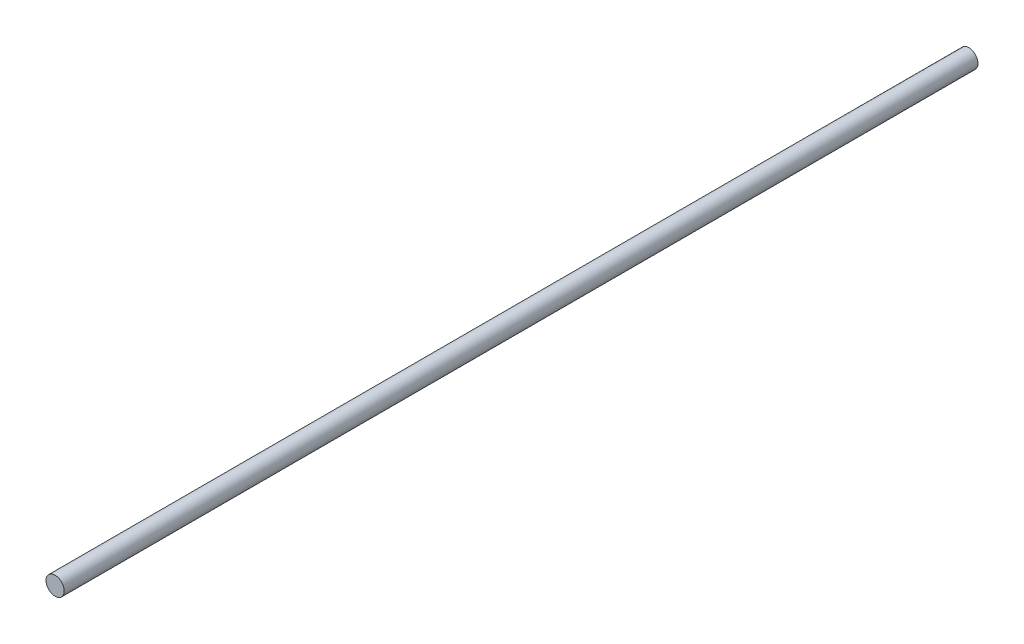
ISO-10303-21;
HEADER;
FILE_DESCRIPTION(('STEP AP214'),'2;1');
FILE_NAME('part.step','',(''),(''),'','','');
FILE_SCHEMA(('AUTOMOTIVE_DESIGN { 1 0 10303 214 1 1 1 1 }'));
ENDSEC;
DATA;
#1=APPLICATION_CONTEXT('core data for automotive mechanical design processes');
#2=APPLICATION_PROTOCOL_DEFINITION('international standard','automotive_design',2000,#1);
#3=PRODUCT_CONTEXT('',#1,'mechanical');
#4=PRODUCT('Part','Part','',(#3));
#5=PRODUCT_RELATED_PRODUCT_CATEGORY('part','',(#4));
#6=PRODUCT_DEFINITION_FORMATION('','',#4);
#7=PRODUCT_DEFINITION_CONTEXT('part definition',#1,'design');
#8=PRODUCT_DEFINITION('design','',#6,#7);
#9=PRODUCT_DEFINITION_SHAPE('','',#8);
#10=(LENGTH_UNIT() NAMED_UNIT(*) SI_UNIT(.MILLI.,.METRE.));
#11=(NAMED_UNIT(*) PLANE_ANGLE_UNIT() SI_UNIT($,.RADIAN.));
#12=(NAMED_UNIT(*) SI_UNIT($,.STERADIAN.) SOLID_ANGLE_UNIT());
#13=UNCERTAINTY_MEASURE_WITH_UNIT(LENGTH_MEASURE(1.E-05),#10,'distance_accuracy_value','');
#14=(GEOMETRIC_REPRESENTATION_CONTEXT(3) GLOBAL_UNCERTAINTY_ASSIGNED_CONTEXT((#13)) GLOBAL_UNIT_ASSIGNED_CONTEXT((#10,
#11,#12)) REPRESENTATION_CONTEXT('',''));
#15=CARTESIAN_POINT('',(0.,0.,0.));
#16=DIRECTION('',(0.,0.,1.));
#17=DIRECTION('',(1.,0.,0.));
#18=AXIS2_PLACEMENT_3D('',#15,#16,#17);
#19=CARTESIAN_POINT('',(0.,0.,50.));
#20=DIRECTION('',(0.,0.,-1.));
#21=DIRECTION('',(-1.,0.,0.));
#22=AXIS2_PLACEMENT_3D('',#19,#20,#21);
#23=CYLINDRICAL_SURFACE('',#22,0.5);
#24=CARTESIAN_POINT('',(0.,0.,50.));
#25=DIRECTION('',(0.,0.,1.));
#26=DIRECTION('',(1.,0.,0.));
#27=AXIS2_PLACEMENT_3D('',#24,#25,#26);
#28=CIRCLE('',#27,0.5);
#29=CARTESIAN_POINT('',(0.5,0.,50.));
#30=VERTEX_POINT('',#29);
#31=EDGE_CURVE('E10',#30,#30,#28,.T.);
#32=ORIENTED_EDGE('',*,*,#31,.F.);
#33=EDGE_LOOP('',(#32));
#34=FACE_BOUND('',#33,.T.);
#35=CARTESIAN_POINT('',(0.,0.,0.));
#36=DIRECTION('',(0.,0.,1.));
#37=DIRECTION('',(1.,0.,0.));
#38=AXIS2_PLACEMENT_3D('',#35,#36,#37);
#39=CIRCLE('',#38,0.5);
#40=CARTESIAN_POINT('',(0.5,0.,0.));
#41=VERTEX_POINT('',#40);
#42=EDGE_CURVE('E40',#41,#41,#39,.T.);
#43=ORIENTED_EDGE('',*,*,#42,.T.);
#44=EDGE_LOOP('',(#43));
#45=FACE_BOUND('',#44,.T.);
#46=ADVANCED_FACE('F37',(#34,#45),#23,.T.);
#47=CARTESIAN_POINT('',(0.,0.,50.));
#48=DIRECTION('',(0.,0.,1.));
#49=DIRECTION('',(1.,0.,0.));
#50=AXIS2_PLACEMENT_3D('',#47,#48,#49);
#51=PLANE('',#50);
#52=ORIENTED_EDGE('',*,*,#31,.T.);
#53=EDGE_LOOP('',(#52));
#54=FACE_BOUND('',#53,.T.);
#55=ADVANCED_FACE('F54',(#54),#51,.T.);
#56=CARTESIAN_POINT('',(0.,0.,0.));
#57=DIRECTION('',(0.,0.,1.));
#58=DIRECTION('',(1.,0.,0.));
#59=AXIS2_PLACEMENT_3D('',#56,#57,#58);
#60=PLANE('',#59);
#61=ORIENTED_EDGE('',*,*,#42,.F.);
#62=EDGE_LOOP('',(#61));
#63=FACE_BOUND('',#62,.T.);
#64=ADVANCED_FACE('F52',(#63),#60,.F.);
#65=CLOSED_SHELL('',(#46,#55,#64));
#66=MANIFOLD_SOLID_BREP('B2',#65);
#67=ADVANCED_BREP_SHAPE_REPRESENTATION('',(#18,#66),#14);
#68=SHAPE_DEFINITION_REPRESENTATION(#9,#67);
ENDSEC;
END-ISO-10303-21;
